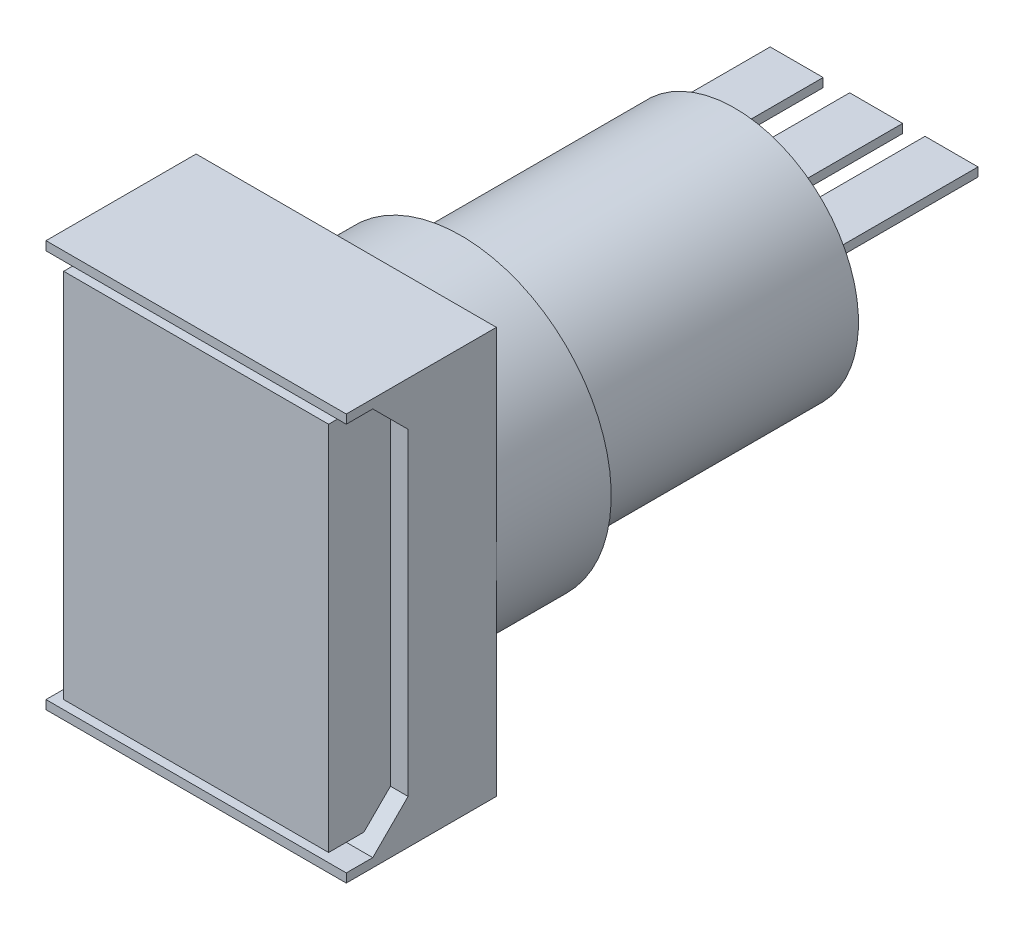
ISO-10303-21;
HEADER;
FILE_DESCRIPTION(('STEP AP214'),'2;1');
FILE_NAME('part.step','',(''),(''),'','','');
FILE_SCHEMA(('AUTOMOTIVE_DESIGN { 1 0 10303 214 1 1 1 1 }'));
ENDSEC;
DATA;
#1=APPLICATION_CONTEXT('core data for automotive mechanical design processes');
#2=APPLICATION_PROTOCOL_DEFINITION('international standard','automotive_design',2000,#1);
#3=PRODUCT_CONTEXT('',#1,'mechanical');
#4=PRODUCT('Part','Part','',(#3));
#5=PRODUCT_RELATED_PRODUCT_CATEGORY('part','',(#4));
#6=PRODUCT_DEFINITION_FORMATION('','',#4);
#7=PRODUCT_DEFINITION_CONTEXT('part definition',#1,'design');
#8=PRODUCT_DEFINITION('design','',#6,#7);
#9=PRODUCT_DEFINITION_SHAPE('','',#8);
#10=(LENGTH_UNIT() NAMED_UNIT(*) SI_UNIT(.MILLI.,.METRE.));
#11=(NAMED_UNIT(*) PLANE_ANGLE_UNIT() SI_UNIT($,.RADIAN.));
#12=(NAMED_UNIT(*) SI_UNIT($,.STERADIAN.) SOLID_ANGLE_UNIT());
#13=UNCERTAINTY_MEASURE_WITH_UNIT(LENGTH_MEASURE(1.E-05),#10,'distance_accuracy_value','');
#14=(GEOMETRIC_REPRESENTATION_CONTEXT(3) GLOBAL_UNCERTAINTY_ASSIGNED_CONTEXT((#13)) GLOBAL_UNIT_ASSIGNED_CONTEXT((#10,
#11,#12)) REPRESENTATION_CONTEXT('',''));
#15=CARTESIAN_POINT('',(0.,0.,0.));
#16=DIRECTION('',(0.,0.,1.));
#17=DIRECTION('',(1.,0.,0.));
#18=AXIS2_PLACEMENT_3D('',#15,#16,#17);
#19=CARTESIAN_POINT('',(-3.,3.,-30.));
#20=DIRECTION('',(0.,-1.,0.));
#21=DIRECTION('',(0.,0.,-1.));
#22=AXIS2_PLACEMENT_3D('',#19,#20,#21);
#23=PLANE('',#22);
#24=DIRECTION('',(0.,0.,1.));
#25=VECTOR('',#24,1.);
#26=CARTESIAN_POINT('',(-5.7662812973354,3.,-22.01));
#27=LINE('',#26,#25);
#28=CARTESIAN_POINT('',(-5.7662812973354,3.,-22.01));
#29=VERTEX_POINT('',#28);
#30=CARTESIAN_POINT('',(-5.7662812973354,3.,-22.));
#31=VERTEX_POINT('',#30);
#32=EDGE_CURVE('E243',#29,#31,#27,.T.);
#33=ORIENTED_EDGE('',*,*,#32,.F.);
#34=DIRECTION('',(1.,0.,0.));
#35=VECTOR('',#34,1.);
#36=CARTESIAN_POINT('',(-3.,3.,-22.01));
#37=LINE('',#36,#35);
#38=CARTESIAN_POINT('',(-3.,3.,-22.01));
#39=VERTEX_POINT('',#38);
#40=EDGE_CURVE('E843',#29,#39,#37,.T.);
#41=ORIENTED_EDGE('',*,*,#40,.T.);
#42=DIRECTION('',(0.,0.,1.));
#43=VECTOR('',#42,1.);
#44=CARTESIAN_POINT('',(-3.,3.,-30.));
#45=LINE('',#44,#43);
#46=CARTESIAN_POINT('',(-3.,3.,-30.));
#47=VERTEX_POINT('',#46);
#48=EDGE_CURVE('E273',#47,#39,#45,.T.);
#49=ORIENTED_EDGE('',*,*,#48,.F.);
#50=DIRECTION('',(1.,0.,0.));
#51=VECTOR('',#50,1.);
#52=CARTESIAN_POINT('',(-3.,3.,-30.));
#53=LINE('',#52,#51);
#54=CARTESIAN_POINT('',(-6.,3.,-30.));
#55=VERTEX_POINT('',#54);
#56=EDGE_CURVE('E836',#55,#47,#53,.T.);
#57=ORIENTED_EDGE('',*,*,#56,.F.);
#58=DIRECTION('',(0.,0.,1.));
#59=VECTOR('',#58,1.);
#60=CARTESIAN_POINT('',(-6.,3.,-30.));
#61=LINE('',#60,#59);
#62=CARTESIAN_POINT('',(-6.,3.,-22.));
#63=VERTEX_POINT('',#62);
#64=EDGE_CURVE('E276',#55,#63,#61,.T.);
#65=ORIENTED_EDGE('',*,*,#64,.T.);
#66=DIRECTION('',(1.,0.,0.));
#67=VECTOR('',#66,1.);
#68=CARTESIAN_POINT('',(-3.,3.,-22.));
#69=LINE('',#68,#67);
#70=EDGE_CURVE('E262',#63,#31,#69,.T.);
#71=ORIENTED_EDGE('',*,*,#70,.T.);
#72=EDGE_LOOP('',(#33,#41,#49,#57,#65,#71));
#73=FACE_BOUND('',#72,.T.);
#74=ADVANCED_FACE('F36',(#73),#23,.F.);
#75=CARTESIAN_POINT('',(0.,0.,-22.));
#76=DIRECTION('',(0.,0.,-1.));
#77=DIRECTION('',(-1.,0.,0.));
#78=AXIS2_PLACEMENT_3D('',#75,#76,#77);
#79=PLANE('',#78);
#80=CARTESIAN_POINT('',(0.,0.,-22.));
#81=DIRECTION('',(0.,0.,-1.));
#82=DIRECTION('',(-1.,0.,0.));
#83=AXIS2_PLACEMENT_3D('',#80,#81,#82);
#84=CIRCLE('',#83,7.);
#85=CARTESIAN_POINT('',(-7.,0.,-22.));
#86=VERTEX_POINT('',#85);
#87=EDGE_CURVE('E320',#86,#86,#84,.T.);
#88=ORIENTED_EDGE('',*,*,#87,.T.);
#89=EDGE_LOOP('',(#88));
#90=FACE_BOUND('',#89,.T.);
#91=CARTESIAN_POINT('',(0.,0.,-22.));
#92=DIRECTION('',(0.,0.,-1.));
#93=DIRECTION('',(-1.,0.,0.));
#94=AXIS2_PLACEMENT_3D('',#91,#92,#93);
#95=CIRCLE('',#94,6.5);
#96=CARTESIAN_POINT('',(-6.,2.5,-22.));
#97=VERTEX_POINT('',#96);
#98=EDGE_CURVE('E236',#31,#97,#95,.T.);
#99=ORIENTED_EDGE('',*,*,#98,.F.);
#100=ORIENTED_EDGE('',*,*,#70,.F.);
#101=DIRECTION('',(0.,1.,0.));
#102=VECTOR('',#101,1.);
#103=CARTESIAN_POINT('',(-6.,3.,-22.));
#104=LINE('',#103,#102);
#105=EDGE_CURVE('E255',#97,#63,#104,.T.);
#106=ORIENTED_EDGE('',*,*,#105,.F.);
#107=EDGE_LOOP('',(#99,#100,#106));
#108=FACE_BOUND('',#107,.T.);
#109=ADVANCED_FACE('F261',(#90,#108),#79,.T.);
#110=CARTESIAN_POINT('',(0.,0.,0.));
#111=DIRECTION('',(0.,0.,-1.));
#112=DIRECTION('',(-1.,0.,0.));
#113=AXIS2_PLACEMENT_3D('',#110,#111,#112);
#114=PLANE('',#113);
#115=CARTESIAN_POINT('',(0.,0.,0.));
#116=DIRECTION('',(0.,0.,-1.));
#117=DIRECTION('',(-1.,0.,0.));
#118=AXIS2_PLACEMENT_3D('',#115,#116,#117);
#119=CIRCLE('',#118,8.5);
#120=CARTESIAN_POINT('',(-8.5,0.,0.));
#121=VERTEX_POINT('',#120);
#122=CARTESIAN_POINT('',(8.5,0.,0.));
#123=VERTEX_POINT('',#122);
#124=EDGE_CURVE('E328',#121,#123,#119,.T.);
#125=ORIENTED_EDGE('',*,*,#124,.F.);
#126=DIRECTION('',(0.,-1.,0.));
#127=VECTOR('',#126,1.);
#128=CARTESIAN_POINT('',(-8.5,11.5,0.));
#129=LINE('',#128,#127);
#130=CARTESIAN_POINT('',(-8.5,11.5,0.));
#131=VERTEX_POINT('',#130);
#132=EDGE_CURVE('E418',#131,#121,#129,.T.);
#133=ORIENTED_EDGE('',*,*,#132,.F.);
#134=DIRECTION('',(-1.,0.,0.));
#135=VECTOR('',#134,1.);
#136=CARTESIAN_POINT('',(8.5,11.5,0.));
#137=LINE('',#136,#135);
#138=CARTESIAN_POINT('',(8.5,11.5,0.));
#139=VERTEX_POINT('',#138);
#140=EDGE_CURVE('E426',#139,#131,#137,.T.);
#141=ORIENTED_EDGE('',*,*,#140,.F.);
#142=DIRECTION('',(0.,1.,0.));
#143=VECTOR('',#142,1.);
#144=CARTESIAN_POINT('',(8.5,11.5,0.));
#145=LINE('',#144,#143);
#146=EDGE_CURVE('E422',#123,#139,#145,.T.);
#147=ORIENTED_EDGE('',*,*,#146,.F.);
#148=EDGE_LOOP('',(#125,#133,#141,#147));
#149=FACE_BOUND('',#148,.T.);
#150=ADVANCED_FACE('F469',(#149),#114,.T.);
#151=CARTESIAN_POINT('',(-11.5,11.,7.));
#152=DIRECTION('',(0.,0.707106781186548,-0.707106781186547));
#153=DIRECTION('',(0.,0.707106781186547,0.707106781186548));
#154=AXIS2_PLACEMENT_3D('',#151,#152,#153);
#155=PLANE('',#154);
#156=DIRECTION('',(0.,-0.707106781186547,-0.707106781186548));
#157=VECTOR('',#156,1.);
#158=CARTESIAN_POINT('',(-7.5,11.,7.));
#159=LINE('',#158,#157);
#160=CARTESIAN_POINT('',(-7.5,10.5,6.5));
#161=VERTEX_POINT('',#160);
#162=CARTESIAN_POINT('',(-7.5,9.00000000000001,5.));
#163=VERTEX_POINT('',#162);
#164=EDGE_CURVE('E360',#161,#163,#159,.T.);
#165=ORIENTED_EDGE('',*,*,#164,.F.);
#166=DIRECTION('',(-1.,0.,0.));
#167=VECTOR('',#166,1.);
#168=CARTESIAN_POINT('',(-11.5,10.5,6.5));
#169=LINE('',#168,#167);
#170=CARTESIAN_POINT('',(7.5,10.5,6.5));
#171=VERTEX_POINT('',#170);
#172=EDGE_CURVE('E454',#171,#161,#169,.T.);
#173=ORIENTED_EDGE('',*,*,#172,.F.);
#174=DIRECTION('',(0.,0.707106781186547,0.707106781186548));
#175=VECTOR('',#174,1.);
#176=CARTESIAN_POINT('',(7.5,11.,7.));
#177=LINE('',#176,#175);
#178=CARTESIAN_POINT('',(7.5,9.00000000000001,5.));
#179=VERTEX_POINT('',#178);
#180=EDGE_CURVE('E357',#179,#171,#177,.T.);
#181=ORIENTED_EDGE('',*,*,#180,.F.);
#182=DIRECTION('',(1.,0.,0.));
#183=VECTOR('',#182,1.);
#184=CARTESIAN_POINT('',(-11.5,9.00000000000001,5.));
#185=LINE('',#184,#183);
#186=CARTESIAN_POINT('',(8.5,9.00000000000001,5.));
#187=VERTEX_POINT('',#186);
#188=EDGE_CURVE('E384',#179,#187,#185,.T.);
#189=ORIENTED_EDGE('',*,*,#188,.T.);
#190=DIRECTION('',(0.,0.707106781186547,0.707106781186548));
#191=VECTOR('',#190,1.);
#192=CARTESIAN_POINT('',(8.5,11.,7.));
#193=LINE('',#192,#191);
#194=CARTESIAN_POINT('',(8.5,11.,7.));
#195=VERTEX_POINT('',#194);
#196=EDGE_CURVE('E372',#187,#195,#193,.T.);
#197=ORIENTED_EDGE('',*,*,#196,.T.);
#198=DIRECTION('',(1.,0.,0.));
#199=VECTOR('',#198,1.);
#200=CARTESIAN_POINT('',(-11.5,11.,7.));
#201=LINE('',#200,#199);
#202=CARTESIAN_POINT('',(-8.5,11.,7.));
#203=VERTEX_POINT('',#202);
#204=EDGE_CURVE('E378',#203,#195,#201,.T.);
#205=ORIENTED_EDGE('',*,*,#204,.F.);
#206=DIRECTION('',(0.,0.707106781186547,0.707106781186548));
#207=VECTOR('',#206,1.);
#208=CARTESIAN_POINT('',(-8.5,12.,8.));
#209=LINE('',#208,#207);
#210=CARTESIAN_POINT('',(-8.5,9.00000000000001,5.));
#211=VERTEX_POINT('',#210);
#212=EDGE_CURVE('E401',#211,#203,#209,.T.);
#213=ORIENTED_EDGE('',*,*,#212,.F.);
#214=EDGE_CURVE('E381',#211,#163,#185,.T.);
#215=ORIENTED_EDGE('',*,*,#214,.T.);
#216=EDGE_LOOP('',(#165,#173,#181,#189,#197,#205,#213,#215));
#217=FACE_BOUND('',#216,.T.);
#218=ADVANCED_FACE('F475',(#217),#155,.F.);
#219=CARTESIAN_POINT('',(-11.5,9.00000000000001,5.));
#220=DIRECTION('',(0.,0.,-1.));
#221=DIRECTION('',(-1.,0.,0.));
#222=AXIS2_PLACEMENT_3D('',#219,#220,#221);
#223=PLANE('',#222);
#224=DIRECTION('',(0.,-1.,0.));
#225=VECTOR('',#224,1.);
#226=CARTESIAN_POINT('',(-7.5,10.5,5.));
#227=LINE('',#226,#225);
#228=CARTESIAN_POINT('',(-7.5,-9.,5.));
#229=VERTEX_POINT('',#228);
#230=EDGE_CURVE('E327',#163,#229,#227,.T.);
#231=ORIENTED_EDGE('',*,*,#230,.F.);
#232=ORIENTED_EDGE('',*,*,#214,.F.);
#233=DIRECTION('',(0.,1.,0.));
#234=VECTOR('',#233,1.);
#235=CARTESIAN_POINT('',(-8.5,11.5,5.));
#236=LINE('',#235,#234);
#237=CARTESIAN_POINT('',(-8.5,-9.,5.));
#238=VERTEX_POINT('',#237);
#239=EDGE_CURVE('E398',#238,#211,#236,.T.);
#240=ORIENTED_EDGE('',*,*,#239,.F.);
#241=DIRECTION('',(1.,0.,0.));
#242=VECTOR('',#241,1.);
#243=CARTESIAN_POINT('',(-11.5,-9.,5.));
#244=LINE('',#243,#242);
#245=EDGE_CURVE('E385',#238,#229,#244,.T.);
#246=ORIENTED_EDGE('',*,*,#245,.T.);
#247=EDGE_LOOP('',(#231,#232,#240,#246));
#248=FACE_BOUND('',#247,.T.);
#249=ADVANCED_FACE('F518',(#248),#223,.F.);
#250=DIRECTION('',(0.,1.,0.));
#251=VECTOR('',#250,1.);
#252=CARTESIAN_POINT('',(7.5,10.5,5.));
#253=LINE('',#252,#251);
#254=CARTESIAN_POINT('',(7.5,-9.00000000000001,5.));
#255=VERTEX_POINT('',#254);
#256=EDGE_CURVE('E335',#255,#179,#253,.T.);
#257=ORIENTED_EDGE('',*,*,#256,.F.);
#258=CARTESIAN_POINT('',(8.5,-9.00000000000001,5.));
#259=VERTEX_POINT('',#258);
#260=EDGE_CURVE('E388',#255,#259,#244,.T.);
#261=ORIENTED_EDGE('',*,*,#260,.T.);
#262=DIRECTION('',(0.,1.,0.));
#263=VECTOR('',#262,1.);
#264=CARTESIAN_POINT('',(8.5,9.00000000000001,5.));
#265=LINE('',#264,#263);
#266=EDGE_CURVE('E369',#259,#187,#265,.T.);
#267=ORIENTED_EDGE('',*,*,#266,.T.);
#268=ORIENTED_EDGE('',*,*,#188,.F.);
#269=EDGE_LOOP('',(#257,#261,#267,#268));
#270=FACE_BOUND('',#269,.T.);
#271=ADVANCED_FACE('F522',(#270),#223,.F.);
#272=CARTESIAN_POINT('',(-11.5,-9.,5.));
#273=DIRECTION('',(0.,-0.707106781186548,-0.707106781186547));
#274=DIRECTION('',(0.,0.707106781186547,-0.707106781186548));
#275=AXIS2_PLACEMENT_3D('',#272,#273,#274);
#276=PLANE('',#275);
#277=DIRECTION('',(0.,-0.707106781186547,0.707106781186548));
#278=VECTOR('',#277,1.);
#279=CARTESIAN_POINT('',(-7.5,-9.,5.));
#280=LINE('',#279,#278);
#281=CARTESIAN_POINT('',(-7.5,-10.5,6.49999999999999));
#282=VERTEX_POINT('',#281);
#283=EDGE_CURVE('E451',#229,#282,#280,.T.);
#284=ORIENTED_EDGE('',*,*,#283,.F.);
#285=ORIENTED_EDGE('',*,*,#245,.F.);
#286=DIRECTION('',(0.,0.707106781186547,-0.707106781186548));
#287=VECTOR('',#286,1.);
#288=CARTESIAN_POINT('',(-8.5,-0.500000000000006,-3.5));
#289=LINE('',#288,#287);
#290=CARTESIAN_POINT('',(-8.5,-11.,7.));
#291=VERTEX_POINT('',#290);
#292=EDGE_CURVE('E395',#291,#238,#289,.T.);
#293=ORIENTED_EDGE('',*,*,#292,.F.);
#294=DIRECTION('',(1.,0.,0.));
#295=VECTOR('',#294,1.);
#296=CARTESIAN_POINT('',(-11.5,-11.,7.));
#297=LINE('',#296,#295);
#298=CARTESIAN_POINT('',(8.5,-11.,7.));
#299=VERTEX_POINT('',#298);
#300=EDGE_CURVE('E377',#291,#299,#297,.T.);
#301=ORIENTED_EDGE('',*,*,#300,.T.);
#302=DIRECTION('',(0.,0.707106781186547,-0.707106781186548));
#303=VECTOR('',#302,1.);
#304=CARTESIAN_POINT('',(8.5,-9.00000000000001,5.));
#305=LINE('',#304,#303);
#306=EDGE_CURVE('E366',#299,#259,#305,.T.);
#307=ORIENTED_EDGE('',*,*,#306,.T.);
#308=ORIENTED_EDGE('',*,*,#260,.F.);
#309=DIRECTION('',(0.,0.707106781186547,-0.707106781186548));
#310=VECTOR('',#309,1.);
#311=CARTESIAN_POINT('',(7.5,-9.,5.));
#312=LINE('',#311,#310);
#313=CARTESIAN_POINT('',(7.5,-10.5,6.49999999999999));
#314=VERTEX_POINT('',#313);
#315=EDGE_CURVE('E445',#314,#255,#312,.T.);
#316=ORIENTED_EDGE('',*,*,#315,.F.);
#317=DIRECTION('',(1.,0.,0.));
#318=VECTOR('',#317,1.);
#319=CARTESIAN_POINT('',(-11.5,-10.5,6.5));
#320=LINE('',#319,#318);
#321=EDGE_CURVE('E448',#282,#314,#320,.T.);
#322=ORIENTED_EDGE('',*,*,#321,.F.);
#323=EDGE_LOOP('',(#284,#285,#293,#301,#307,#308,#316,#322));
#324=FACE_BOUND('',#323,.T.);
#325=ADVANCED_FACE('F524',(#324),#276,.F.);
#326=CARTESIAN_POINT('',(0.,0.,8.5));
#327=DIRECTION('',(0.,0.,-1.));
#328=DIRECTION('',(-1.,0.,0.));
#329=AXIS2_PLACEMENT_3D('',#326,#327,#328);
#330=PLANE('',#329);
#331=DIRECTION('',(0.,-1.,0.));
#332=VECTOR('',#331,1.);
#333=CARTESIAN_POINT('',(-8.5,11.5,8.5));
#334=LINE('',#333,#332);
#335=CARTESIAN_POINT('',(-8.5,11.5,8.5));
#336=VERTEX_POINT('',#335);
#337=CARTESIAN_POINT('',(-8.5,11.,8.5));
#338=VERTEX_POINT('',#337);
#339=EDGE_CURVE('E405',#336,#338,#334,.T.);
#340=ORIENTED_EDGE('',*,*,#339,.T.);
#341=DIRECTION('',(1.,0.,0.));
#342=VECTOR('',#341,1.);
#343=CARTESIAN_POINT('',(0.,11.,8.5));
#344=LINE('',#343,#342);
#345=CARTESIAN_POINT('',(8.5,11.,8.5));
#346=VERTEX_POINT('',#345);
#347=EDGE_CURVE('E442',#338,#346,#344,.T.);
#348=ORIENTED_EDGE('',*,*,#347,.T.);
#349=DIRECTION('',(0.,1.,0.));
#350=VECTOR('',#349,1.);
#351=CARTESIAN_POINT('',(8.5,11.5,8.5));
#352=LINE('',#351,#350);
#353=CARTESIAN_POINT('',(8.5,11.5,8.5));
#354=VERTEX_POINT('',#353);
#355=EDGE_CURVE('E411',#346,#354,#352,.T.);
#356=ORIENTED_EDGE('',*,*,#355,.T.);
#357=DIRECTION('',(-1.,0.,0.));
#358=VECTOR('',#357,1.);
#359=CARTESIAN_POINT('',(8.5,11.5,8.5));
#360=LINE('',#359,#358);
#361=EDGE_CURVE('E415',#354,#336,#360,.T.);
#362=ORIENTED_EDGE('',*,*,#361,.T.);
#363=EDGE_LOOP('',(#340,#348,#356,#362));
#364=FACE_BOUND('',#363,.T.);
#365=ADVANCED_FACE('F527',(#364),#330,.F.);
#366=CARTESIAN_POINT('',(-8.5,11.5,8.5));
#367=DIRECTION('',(1.,0.,0.));
#368=DIRECTION('',(0.,1.,0.));
#369=AXIS2_PLACEMENT_3D('',#366,#367,#368);
#370=PLANE('',#369);
#371=ORIENTED_EDGE('',*,*,#212,.T.);
#372=DIRECTION('',(0.,0.,1.));
#373=VECTOR('',#372,1.);
#374=CARTESIAN_POINT('',(-8.5,11.,8.5));
#375=LINE('',#374,#373);
#376=EDGE_CURVE('E392',#203,#338,#375,.T.);
#377=ORIENTED_EDGE('',*,*,#376,.T.);
#378=ORIENTED_EDGE('',*,*,#339,.F.);
#379=DIRECTION('',(0.,0.,-1.));
#380=VECTOR('',#379,1.);
#381=CARTESIAN_POINT('',(-8.5,11.5,8.5));
#382=LINE('',#381,#380);
#383=EDGE_CURVE('E417',#336,#131,#382,.T.);
#384=ORIENTED_EDGE('',*,*,#383,.T.);
#385=ORIENTED_EDGE('',*,*,#132,.T.);
#386=CARTESIAN_POINT('',(-8.5,-11.5,0.));
#387=VERTEX_POINT('',#386);
#388=EDGE_CURVE('E404',#121,#387,#129,.T.);
#389=ORIENTED_EDGE('',*,*,#388,.T.);
#390=DIRECTION('',(0.,0.,-1.));
#391=VECTOR('',#390,1.);
#392=CARTESIAN_POINT('',(-8.5,-11.5,8.5));
#393=LINE('',#392,#391);
#394=CARTESIAN_POINT('',(-8.5,-11.5,8.5));
#395=VERTEX_POINT('',#394);
#396=EDGE_CURVE('E436',#395,#387,#393,.T.);
#397=ORIENTED_EDGE('',*,*,#396,.F.);
#398=CARTESIAN_POINT('',(-8.5,-11.,8.5));
#399=VERTEX_POINT('',#398);
#400=EDGE_CURVE('E409',#399,#395,#334,.T.);
#401=ORIENTED_EDGE('',*,*,#400,.F.);
#402=DIRECTION('',(0.,0.,-1.));
#403=VECTOR('',#402,1.);
#404=CARTESIAN_POINT('',(-8.5,-11.,8.5));
#405=LINE('',#404,#403);
#406=EDGE_CURVE('E380',#399,#291,#405,.T.);
#407=ORIENTED_EDGE('',*,*,#406,.T.);
#408=ORIENTED_EDGE('',*,*,#292,.T.);
#409=ORIENTED_EDGE('',*,*,#239,.T.);
#410=EDGE_LOOP('',(#371,#377,#378,#384,#385,#389,#397,#401,#407,#408,#409));
#411=FACE_BOUND('',#410,.T.);
#412=ADVANCED_FACE('F38',(#411),#370,.F.);
#413=CARTESIAN_POINT('',(8.5,-11.5,8.5));
#414=DIRECTION('',(0.,1.,0.));
#415=DIRECTION('',(-1.,0.,0.));
#416=AXIS2_PLACEMENT_3D('',#413,#414,#415);
#417=PLANE('',#416);
#418=DIRECTION('',(1.,0.,0.));
#419=VECTOR('',#418,1.);
#420=CARTESIAN_POINT('',(8.5,-11.5,0.));
#421=LINE('',#420,#419);
#422=CARTESIAN_POINT('',(8.5,-11.5,0.));
#423=VERTEX_POINT('',#422);
#424=EDGE_CURVE('E420',#387,#423,#421,.T.);
#425=ORIENTED_EDGE('',*,*,#424,.T.);
#426=DIRECTION('',(0.,0.,-1.));
#427=VECTOR('',#426,1.);
#428=CARTESIAN_POINT('',(8.5,-11.5,8.5));
#429=LINE('',#428,#427);
#430=CARTESIAN_POINT('',(8.5,-11.5,8.5));
#431=VERTEX_POINT('',#430);
#432=EDGE_CURVE('E433',#431,#423,#429,.T.);
#433=ORIENTED_EDGE('',*,*,#432,.F.);
#434=DIRECTION('',(1.,0.,0.));
#435=VECTOR('',#434,1.);
#436=CARTESIAN_POINT('',(8.5,-11.5,8.5));
#437=LINE('',#436,#435);
#438=EDGE_CURVE('E408',#395,#431,#437,.T.);
#439=ORIENTED_EDGE('',*,*,#438,.F.);
#440=ORIENTED_EDGE('',*,*,#396,.T.);
#441=EDGE_LOOP('',(#425,#433,#439,#440));
#442=FACE_BOUND('',#441,.T.);
#443=ADVANCED_FACE('F544',(#442),#417,.F.);
#444=CARTESIAN_POINT('',(8.5,11.5,8.5));
#445=DIRECTION('',(-1.,0.,0.));
#446=DIRECTION('',(0.,-1.,0.));
#447=AXIS2_PLACEMENT_3D('',#444,#445,#446);
#448=PLANE('',#447);
#449=ORIENTED_EDGE('',*,*,#355,.F.);
#450=DIRECTION('',(0.,0.,1.));
#451=VECTOR('',#450,1.);
#452=CARTESIAN_POINT('',(8.5,11.,8.5));
#453=LINE('',#452,#451);
#454=EDGE_CURVE('E375',#195,#346,#453,.T.);
#455=ORIENTED_EDGE('',*,*,#454,.F.);
#456=ORIENTED_EDGE('',*,*,#196,.F.);
#457=ORIENTED_EDGE('',*,*,#266,.F.);
#458=ORIENTED_EDGE('',*,*,#306,.F.);
#459=DIRECTION('',(0.,0.,-1.));
#460=VECTOR('',#459,1.);
#461=CARTESIAN_POINT('',(8.5,-11.,7.));
#462=LINE('',#461,#460);
#463=CARTESIAN_POINT('',(8.5,-11.,8.5));
#464=VERTEX_POINT('',#463);
#465=EDGE_CURVE('E363',#464,#299,#462,.T.);
#466=ORIENTED_EDGE('',*,*,#465,.F.);
#467=EDGE_CURVE('E412',#431,#464,#352,.T.);
#468=ORIENTED_EDGE('',*,*,#467,.F.);
#469=ORIENTED_EDGE('',*,*,#432,.T.);
#470=EDGE_CURVE('E423',#423,#123,#145,.T.);
#471=ORIENTED_EDGE('',*,*,#470,.T.);
#472=ORIENTED_EDGE('',*,*,#146,.T.);
#473=DIRECTION('',(0.,0.,-1.));
#474=VECTOR('',#473,1.);
#475=CARTESIAN_POINT('',(8.5,11.5,8.5));
#476=LINE('',#475,#474);
#477=EDGE_CURVE('E430',#354,#139,#476,.T.);
#478=ORIENTED_EDGE('',*,*,#477,.F.);
#479=EDGE_LOOP('',(#449,#455,#456,#457,#458,#466,#468,#469,#471,#472,#478));
#480=FACE_BOUND('',#479,.T.);
#481=ADVANCED_FACE('F541',(#480),#448,.F.);
#482=CARTESIAN_POINT('',(8.5,11.5,8.5));
#483=DIRECTION('',(0.,-1.,0.));
#484=DIRECTION('',(1.,0.,0.));
#485=AXIS2_PLACEMENT_3D('',#482,#483,#484);
#486=PLANE('',#485);
#487=ORIENTED_EDGE('',*,*,#140,.T.);
#488=ORIENTED_EDGE('',*,*,#383,.F.);
#489=ORIENTED_EDGE('',*,*,#361,.F.);
#490=ORIENTED_EDGE('',*,*,#477,.T.);
#491=EDGE_LOOP('',(#487,#488,#489,#490));
#492=FACE_BOUND('',#491,.T.);
#493=ADVANCED_FACE('F534',(#492),#486,.F.);
#494=ORIENTED_EDGE('',*,*,#467,.T.);
#495=DIRECTION('',(-1.,0.,0.));
#496=VECTOR('',#495,1.);
#497=CARTESIAN_POINT('',(0.,-11.,8.5));
#498=LINE('',#497,#496);
#499=EDGE_CURVE('E439',#464,#399,#498,.T.);
#500=ORIENTED_EDGE('',*,*,#499,.T.);
#501=ORIENTED_EDGE('',*,*,#400,.T.);
#502=ORIENTED_EDGE('',*,*,#438,.T.);
#503=EDGE_LOOP('',(#494,#500,#501,#502));
#504=FACE_BOUND('',#503,.T.);
#505=ADVANCED_FACE('F532',(#504),#330,.F.);
#506=EDGE_CURVE('E44',#123,#121,#119,.T.);
#507=ORIENTED_EDGE('',*,*,#506,.F.);
#508=ORIENTED_EDGE('',*,*,#470,.F.);
#509=ORIENTED_EDGE('',*,*,#424,.F.);
#510=ORIENTED_EDGE('',*,*,#388,.F.);
#511=EDGE_LOOP('',(#507,#508,#509,#510));
#512=FACE_BOUND('',#511,.T.);
#513=ADVANCED_FACE('F478',(#512),#114,.T.);
#514=CARTESIAN_POINT('',(-11.5,11.,8.5));
#515=DIRECTION('',(0.,1.,0.));
#516=DIRECTION('',(-1.,0.,0.));
#517=AXIS2_PLACEMENT_3D('',#514,#515,#516);
#518=PLANE('',#517);
#519=ORIENTED_EDGE('',*,*,#204,.T.);
#520=ORIENTED_EDGE('',*,*,#454,.T.);
#521=ORIENTED_EDGE('',*,*,#347,.F.);
#522=ORIENTED_EDGE('',*,*,#376,.F.);
#523=EDGE_LOOP('',(#519,#520,#521,#522));
#524=FACE_BOUND('',#523,.T.);
#525=ADVANCED_FACE('F512',(#524),#518,.F.);
#526=CARTESIAN_POINT('',(-11.5,-11.,7.));
#527=DIRECTION('',(0.,-1.,0.));
#528=DIRECTION('',(1.,0.,0.));
#529=AXIS2_PLACEMENT_3D('',#526,#527,#528);
#530=PLANE('',#529);
#531=ORIENTED_EDGE('',*,*,#499,.F.);
#532=ORIENTED_EDGE('',*,*,#465,.T.);
#533=ORIENTED_EDGE('',*,*,#300,.F.);
#534=ORIENTED_EDGE('',*,*,#406,.F.);
#535=EDGE_LOOP('',(#531,#532,#533,#534));
#536=FACE_BOUND('',#535,.T.);
#537=ADVANCED_FACE('F500',(#536),#530,.F.);
#538=CARTESIAN_POINT('',(7.5,10.5,8.5));
#539=DIRECTION('',(0.,-1.,0.));
#540=DIRECTION('',(0.,0.,-1.));
#541=AXIS2_PLACEMENT_3D('',#538,#539,#540);
#542=PLANE('',#541);
#543=DIRECTION('',(0.,0.,-1.));
#544=VECTOR('',#543,1.);
#545=CARTESIAN_POINT('',(7.5,10.5,8.5));
#546=LINE('',#545,#544);
#547=CARTESIAN_POINT('',(7.5,10.5,8.5));
#548=VERTEX_POINT('',#547);
#549=EDGE_CURVE('E348',#548,#171,#546,.T.);
#550=ORIENTED_EDGE('',*,*,#549,.T.);
#551=ORIENTED_EDGE('',*,*,#172,.T.);
#552=DIRECTION('',(0.,0.,-1.));
#553=VECTOR('',#552,1.);
#554=CARTESIAN_POINT('',(-7.5,10.5,8.5));
#555=LINE('',#554,#553);
#556=CARTESIAN_POINT('',(-7.5,10.5,8.5));
#557=VERTEX_POINT('',#556);
#558=EDGE_CURVE('E341',#557,#161,#555,.T.);
#559=ORIENTED_EDGE('',*,*,#558,.F.);
#560=DIRECTION('',(-1.,0.,0.));
#561=VECTOR('',#560,1.);
#562=CARTESIAN_POINT('',(7.5,10.5,8.5));
#563=LINE('',#562,#561);
#564=EDGE_CURVE('E339',#548,#557,#563,.T.);
#565=ORIENTED_EDGE('',*,*,#564,.F.);
#566=EDGE_LOOP('',(#550,#551,#559,#565));
#567=FACE_BOUND('',#566,.T.);
#568=ADVANCED_FACE('F496',(#567),#542,.F.);
#569=CARTESIAN_POINT('',(-7.5,10.5,8.5));
#570=DIRECTION('',(1.,0.,0.));
#571=DIRECTION('',(0.,1.,0.));
#572=AXIS2_PLACEMENT_3D('',#569,#570,#571);
#573=PLANE('',#572);
#574=ORIENTED_EDGE('',*,*,#558,.T.);
#575=ORIENTED_EDGE('',*,*,#164,.T.);
#576=ORIENTED_EDGE('',*,*,#230,.T.);
#577=ORIENTED_EDGE('',*,*,#283,.T.);
#578=DIRECTION('',(0.,0.,-1.));
#579=VECTOR('',#578,1.);
#580=CARTESIAN_POINT('',(-7.5,-10.5,8.5));
#581=LINE('',#580,#579);
#582=CARTESIAN_POINT('',(-7.5,-10.5,8.5));
#583=VERTEX_POINT('',#582);
#584=EDGE_CURVE('E354',#583,#282,#581,.T.);
#585=ORIENTED_EDGE('',*,*,#584,.F.);
#586=DIRECTION('',(0.,-1.,0.));
#587=VECTOR('',#586,1.);
#588=CARTESIAN_POINT('',(-7.5,10.5,8.5));
#589=LINE('',#588,#587);
#590=EDGE_CURVE('E331',#557,#583,#589,.T.);
#591=ORIENTED_EDGE('',*,*,#590,.F.);
#592=EDGE_LOOP('',(#574,#575,#576,#577,#585,#591));
#593=FACE_BOUND('',#592,.T.);
#594=ADVANCED_FACE('F499',(#593),#573,.F.);
#595=CARTESIAN_POINT('',(7.5,-10.5,8.5));
#596=DIRECTION('',(0.,1.,0.));
#597=DIRECTION('',(-1.,0.,0.));
#598=AXIS2_PLACEMENT_3D('',#595,#596,#597);
#599=PLANE('',#598);
#600=ORIENTED_EDGE('',*,*,#584,.T.);
#601=ORIENTED_EDGE('',*,*,#321,.T.);
#602=DIRECTION('',(0.,0.,-1.));
#603=VECTOR('',#602,1.);
#604=CARTESIAN_POINT('',(7.5,-10.5,8.5));
#605=LINE('',#604,#603);
#606=CARTESIAN_POINT('',(7.5,-10.5,8.5));
#607=VERTEX_POINT('',#606);
#608=EDGE_CURVE('E351',#607,#314,#605,.T.);
#609=ORIENTED_EDGE('',*,*,#608,.F.);
#610=DIRECTION('',(1.,0.,0.));
#611=VECTOR('',#610,1.);
#612=CARTESIAN_POINT('',(7.5,-10.5,8.5));
#613=LINE('',#612,#611);
#614=EDGE_CURVE('E334',#583,#607,#613,.T.);
#615=ORIENTED_EDGE('',*,*,#614,.F.);
#616=EDGE_LOOP('',(#600,#601,#609,#615));
#617=FACE_BOUND('',#616,.T.);
#618=ADVANCED_FACE('F504',(#617),#599,.F.);
#619=CARTESIAN_POINT('',(7.5,10.5,8.5));
#620=DIRECTION('',(-1.,0.,0.));
#621=DIRECTION('',(0.,-1.,0.));
#622=AXIS2_PLACEMENT_3D('',#619,#620,#621);
#623=PLANE('',#622);
#624=ORIENTED_EDGE('',*,*,#256,.T.);
#625=ORIENTED_EDGE('',*,*,#180,.T.);
#626=ORIENTED_EDGE('',*,*,#549,.F.);
#627=DIRECTION('',(0.,1.,0.));
#628=VECTOR('',#627,1.);
#629=CARTESIAN_POINT('',(7.5,10.5,8.5));
#630=LINE('',#629,#628);
#631=EDGE_CURVE('E337',#607,#548,#630,.T.);
#632=ORIENTED_EDGE('',*,*,#631,.F.);
#633=ORIENTED_EDGE('',*,*,#608,.T.);
#634=ORIENTED_EDGE('',*,*,#315,.T.);
#635=EDGE_LOOP('',(#624,#625,#626,#632,#633,#634));
#636=FACE_BOUND('',#635,.T.);
#637=ADVANCED_FACE('F494',(#636),#623,.F.);
#638=CARTESIAN_POINT('',(0.,0.,8.5));
#639=DIRECTION('',(0.,0.,-1.));
#640=DIRECTION('',(-1.,0.,0.));
#641=AXIS2_PLACEMENT_3D('',#638,#639,#640);
#642=PLANE('',#641);
#643=ORIENTED_EDGE('',*,*,#590,.T.);
#644=ORIENTED_EDGE('',*,*,#614,.T.);
#645=ORIENTED_EDGE('',*,*,#631,.T.);
#646=ORIENTED_EDGE('',*,*,#564,.T.);
#647=EDGE_LOOP('',(#643,#644,#645,#646));
#648=FACE_BOUND('',#647,.T.);
#649=ADVANCED_FACE('F490',(#648),#642,.F.);
#650=CARTESIAN_POINT('',(0.,0.,-6.5));
#651=DIRECTION('',(0.,0.,1.));
#652=DIRECTION('',(1.,0.,0.));
#653=AXIS2_PLACEMENT_3D('',#650,#651,#652);
#654=CYLINDRICAL_SURFACE('',#653,8.5);
#655=CARTESIAN_POINT('',(0.,0.,-6.5));
#656=DIRECTION('',(0.,0.,-1.));
#657=DIRECTION('',(-1.,0.,0.));
#658=AXIS2_PLACEMENT_3D('',#655,#656,#657);
#659=CIRCLE('',#658,8.5);
#660=CARTESIAN_POINT('',(-8.5,0.,-6.5));
#661=VERTEX_POINT('',#660);
#662=EDGE_CURVE('E324',#661,#661,#659,.T.);
#663=ORIENTED_EDGE('',*,*,#662,.F.);
#664=EDGE_LOOP('',(#663));
#665=FACE_BOUND('',#664,.T.);
#666=ORIENTED_EDGE('',*,*,#124,.T.);
#667=ORIENTED_EDGE('',*,*,#506,.T.);
#668=EDGE_LOOP('',(#666,#667));
#669=FACE_BOUND('',#668,.T.);
#670=ADVANCED_FACE('F487',(#665,#669),#654,.T.);
#671=CARTESIAN_POINT('',(0.,0.,-6.5));
#672=DIRECTION('',(0.,0.,-1.));
#673=DIRECTION('',(-1.,0.,0.));
#674=AXIS2_PLACEMENT_3D('',#671,#672,#673);
#675=PLANE('',#674);
#676=CARTESIAN_POINT('',(0.,0.,-6.5));
#677=DIRECTION('',(0.,0.,-1.));
#678=DIRECTION('',(-1.,0.,0.));
#679=AXIS2_PLACEMENT_3D('',#676,#677,#678);
#680=CIRCLE('',#679,7.);
#681=CARTESIAN_POINT('',(-7.,0.,-6.5));
#682=VERTEX_POINT('',#681);
#683=EDGE_CURVE('E323',#682,#682,#680,.F.);
#684=ORIENTED_EDGE('',*,*,#683,.T.);
#685=EDGE_LOOP('',(#684));
#686=FACE_BOUND('',#685,.T.);
#687=ORIENTED_EDGE('',*,*,#662,.T.);
#688=EDGE_LOOP('',(#687));
#689=FACE_BOUND('',#688,.T.);
#690=ADVANCED_FACE('F459',(#686,#689),#675,.T.);
#691=CARTESIAN_POINT('',(0.,0.,-22.));
#692=DIRECTION('',(0.,0.,1.));
#693=DIRECTION('',(1.,0.,0.));
#694=AXIS2_PLACEMENT_3D('',#691,#692,#693);
#695=CYLINDRICAL_SURFACE('',#694,7.);
#696=ORIENTED_EDGE('',*,*,#683,.F.);
#697=EDGE_LOOP('',(#696));
#698=FACE_BOUND('',#697,.T.);
#699=ORIENTED_EDGE('',*,*,#87,.F.);
#700=EDGE_LOOP('',(#699));
#701=FACE_BOUND('',#700,.T.);
#702=ADVANCED_FACE('F462',(#698,#701),#695,.T.);
#703=CARTESIAN_POINT('',(-6.,3.,-30.));
#704=DIRECTION('',(1.,0.,0.));
#705=DIRECTION('',(0.,1.,0.));
#706=AXIS2_PLACEMENT_3D('',#703,#704,#705);
#707=PLANE('',#706);
#708=ORIENTED_EDGE('',*,*,#105,.T.);
#709=ORIENTED_EDGE('',*,*,#64,.F.);
#710=DIRECTION('',(0.,1.,0.));
#711=VECTOR('',#710,1.);
#712=CARTESIAN_POINT('',(-6.,3.,-30.));
#713=LINE('',#712,#711);
#714=CARTESIAN_POINT('',(-6.,2.5,-30.));
#715=VERTEX_POINT('',#714);
#716=EDGE_CURVE('E264',#715,#55,#713,.T.);
#717=ORIENTED_EDGE('',*,*,#716,.F.);
#718=DIRECTION('',(0.,0.,1.));
#719=VECTOR('',#718,1.);
#720=CARTESIAN_POINT('',(-6.,2.5,-30.));
#721=LINE('',#720,#719);
#722=CARTESIAN_POINT('',(-6.,2.5,-22.01));
#723=VERTEX_POINT('',#722);
#724=EDGE_CURVE('E258',#715,#723,#721,.T.);
#725=ORIENTED_EDGE('',*,*,#724,.T.);
#726=EDGE_CURVE('E240',#723,#97,#721,.T.);
#727=ORIENTED_EDGE('',*,*,#726,.T.);
#728=EDGE_LOOP('',(#708,#709,#717,#725,#727));
#729=FACE_BOUND('',#728,.T.);
#730=ADVANCED_FACE('F253',(#729),#707,.F.);
#731=CARTESIAN_POINT('',(-3.,3.,-30.));
#732=DIRECTION('',(-1.,0.,0.));
#733=DIRECTION('',(0.,0.,1.));
#734=AXIS2_PLACEMENT_3D('',#731,#732,#733);
#735=PLANE('',#734);
#736=ORIENTED_EDGE('',*,*,#48,.T.);
#737=DIRECTION('',(0.,-1.,0.));
#738=VECTOR('',#737,1.);
#739=CARTESIAN_POINT('',(-3.,3.,-22.01));
#740=LINE('',#739,#738);
#741=CARTESIAN_POINT('',(-3.,2.5,-22.01));
#742=VERTEX_POINT('',#741);
#743=EDGE_CURVE('E845',#39,#742,#740,.T.);
#744=ORIENTED_EDGE('',*,*,#743,.T.);
#745=DIRECTION('',(0.,0.,1.));
#746=VECTOR('',#745,1.);
#747=CARTESIAN_POINT('',(-3.,2.5,-30.));
#748=LINE('',#747,#746);
#749=CARTESIAN_POINT('',(-3.,2.5,-30.));
#750=VERTEX_POINT('',#749);
#751=EDGE_CURVE('E270',#750,#742,#748,.T.);
#752=ORIENTED_EDGE('',*,*,#751,.F.);
#753=DIRECTION('',(0.,-1.,0.));
#754=VECTOR('',#753,1.);
#755=CARTESIAN_POINT('',(-3.,3.,-30.));
#756=LINE('',#755,#754);
#757=EDGE_CURVE('E837',#47,#750,#756,.T.);
#758=ORIENTED_EDGE('',*,*,#757,.F.);
#759=EDGE_LOOP('',(#736,#744,#752,#758));
#760=FACE_BOUND('',#759,.T.);
#761=ADVANCED_FACE('F715',(#760),#735,.F.);
#762=CARTESIAN_POINT('',(-3.,2.5,-30.));
#763=DIRECTION('',(0.,1.,0.));
#764=DIRECTION('',(0.,0.,1.));
#765=AXIS2_PLACEMENT_3D('',#762,#763,#764);
#766=PLANE('',#765);
#767=ORIENTED_EDGE('',*,*,#751,.T.);
#768=DIRECTION('',(-1.,0.,0.));
#769=VECTOR('',#768,1.);
#770=CARTESIAN_POINT('',(-3.,2.5,-22.01));
#771=LINE('',#770,#769);
#772=EDGE_CURVE('E11',#742,#723,#771,.T.);
#773=ORIENTED_EDGE('',*,*,#772,.T.);
#774=ORIENTED_EDGE('',*,*,#724,.F.);
#775=DIRECTION('',(-1.,0.,0.));
#776=VECTOR('',#775,1.);
#777=CARTESIAN_POINT('',(-3.,2.5,-30.));
#778=LINE('',#777,#776);
#779=EDGE_CURVE('E259',#750,#715,#778,.T.);
#780=ORIENTED_EDGE('',*,*,#779,.F.);
#781=EDGE_LOOP('',(#767,#773,#774,#780));
#782=FACE_BOUND('',#781,.T.);
#783=ADVANCED_FACE('F693',(#782),#766,.F.);
#784=CARTESIAN_POINT('',(0.,0.,-30.));
#785=DIRECTION('',(0.,0.,-1.));
#786=DIRECTION('',(-1.,0.,0.));
#787=AXIS2_PLACEMENT_3D('',#784,#785,#786);
#788=PLANE('',#787);
#789=ORIENTED_EDGE('',*,*,#716,.T.);
#790=ORIENTED_EDGE('',*,*,#56,.T.);
#791=ORIENTED_EDGE('',*,*,#757,.T.);
#792=ORIENTED_EDGE('',*,*,#779,.T.);
#793=EDGE_LOOP('',(#789,#790,#791,#792));
#794=FACE_BOUND('',#793,.T.);
#795=ADVANCED_FACE('F688',(#794),#788,.T.);
#796=CARTESIAN_POINT('',(0.,0.,-22.01));
#797=DIRECTION('',(0.,0.,1.));
#798=DIRECTION('',(1.,0.,0.));
#799=AXIS2_PLACEMENT_3D('',#796,#797,#798);
#800=CYLINDRICAL_SURFACE('',#799,6.5);
#801=CARTESIAN_POINT('',(0.,0.,-22.01));
#802=DIRECTION('',(0.,0.,-1.));
#803=DIRECTION('',(-1.,0.,0.));
#804=AXIS2_PLACEMENT_3D('',#801,#802,#803);
#805=CIRCLE('',#804,6.5);
#806=CARTESIAN_POINT('',(5.7662812973354,3.,-22.01));
#807=VERTEX_POINT('',#806);
#808=EDGE_CURVE('E248',#807,#723,#805,.T.);
#809=ORIENTED_EDGE('',*,*,#808,.F.);
#810=EDGE_CURVE('E846',#29,#807,#805,.T.);
#811=ORIENTED_EDGE('',*,*,#810,.F.);
#812=ORIENTED_EDGE('',*,*,#32,.T.);
#813=ORIENTED_EDGE('',*,*,#98,.T.);
#814=ORIENTED_EDGE('',*,*,#726,.F.);
#815=EDGE_LOOP('',(#809,#811,#812,#813,#814));
#816=FACE_BOUND('',#815,.T.);
#817=ADVANCED_FACE('F239',(#816),#800,.T.);
#818=CARTESIAN_POINT('',(0.,0.,-22.01));
#819=DIRECTION('',(0.,0.,-1.));
#820=DIRECTION('',(-1.,0.,0.));
#821=AXIS2_PLACEMENT_3D('',#818,#819,#820);
#822=PLANE('',#821);
#823=DIRECTION('',(0.,1.,0.));
#824=VECTOR('',#823,1.);
#825=CARTESIAN_POINT('',(-1.5,3.,-22.01));
#826=LINE('',#825,#824);
#827=CARTESIAN_POINT('',(-1.5,2.5,-22.01));
#828=VERTEX_POINT('',#827);
#829=CARTESIAN_POINT('',(-1.5,3.,-22.01));
#830=VERTEX_POINT('',#829);
#831=EDGE_CURVE('E59',#828,#830,#826,.T.);
#832=ORIENTED_EDGE('',*,*,#831,.F.);
#833=DIRECTION('',(-1.,0.,0.));
#834=VECTOR('',#833,1.);
#835=CARTESIAN_POINT('',(1.5,2.5,-22.01));
#836=LINE('',#835,#834);
#837=CARTESIAN_POINT('',(1.5,2.5,-22.01));
#838=VERTEX_POINT('',#837);
#839=EDGE_CURVE('E848',#838,#828,#836,.T.);
#840=ORIENTED_EDGE('',*,*,#839,.F.);
#841=DIRECTION('',(0.,-1.,0.));
#842=VECTOR('',#841,1.);
#843=CARTESIAN_POINT('',(1.5,3.,-22.01));
#844=LINE('',#843,#842);
#845=CARTESIAN_POINT('',(1.5,3.,-22.01));
#846=VERTEX_POINT('',#845);
#847=EDGE_CURVE('E854',#846,#838,#844,.T.);
#848=ORIENTED_EDGE('',*,*,#847,.F.);
#849=DIRECTION('',(1.,0.,0.));
#850=VECTOR('',#849,1.);
#851=CARTESIAN_POINT('',(1.5,3.,-22.01));
#852=LINE('',#851,#850);
#853=EDGE_CURVE('E827',#830,#846,#852,.T.);
#854=ORIENTED_EDGE('',*,*,#853,.F.);
#855=EDGE_LOOP('',(#832,#840,#848,#854));
#856=FACE_BOUND('',#855,.T.);
#857=DIRECTION('',(0.,1.,0.));
#858=VECTOR('',#857,1.);
#859=CARTESIAN_POINT('',(2.7662812973354,3.,-22.01));
#860=LINE('',#859,#858);
#861=CARTESIAN_POINT('',(2.7662812973354,2.5,-22.01));
#862=VERTEX_POINT('',#861);
#863=CARTESIAN_POINT('',(2.7662812973354,3.,-22.01));
#864=VERTEX_POINT('',#863);
#865=EDGE_CURVE('E51',#862,#864,#860,.T.);
#866=ORIENTED_EDGE('',*,*,#865,.F.);
#867=DIRECTION('',(-1.,0.,0.));
#868=VECTOR('',#867,1.);
#869=CARTESIAN_POINT('',(5.7662812973354,2.5,-22.01));
#870=LINE('',#869,#868);
#871=CARTESIAN_POINT('',(5.7662812973354,2.5,-22.01));
#872=VERTEX_POINT('',#871);
#873=EDGE_CURVE('E820',#872,#862,#870,.T.);
#874=ORIENTED_EDGE('',*,*,#873,.F.);
#875=DIRECTION('',(0.,-1.,0.));
#876=VECTOR('',#875,1.);
#877=CARTESIAN_POINT('',(5.7662812973354,3.,-22.01));
#878=LINE('',#877,#876);
#879=EDGE_CURVE('E823',#807,#872,#878,.T.);
#880=ORIENTED_EDGE('',*,*,#879,.F.);
#881=ORIENTED_EDGE('',*,*,#808,.T.);
#882=ORIENTED_EDGE('',*,*,#772,.F.);
#883=ORIENTED_EDGE('',*,*,#743,.F.);
#884=ORIENTED_EDGE('',*,*,#40,.F.);
#885=ORIENTED_EDGE('',*,*,#810,.T.);
#886=DIRECTION('',(1.,0.,0.));
#887=VECTOR('',#886,1.);
#888=CARTESIAN_POINT('',(5.7662812973354,3.,-22.01));
#889=LINE('',#888,#887);
#890=EDGE_CURVE('E825',#864,#807,#889,.T.);
#891=ORIENTED_EDGE('',*,*,#890,.F.);
#892=EDGE_LOOP('',(#866,#874,#880,#881,#882,#883,#884,#885,#891));
#893=FACE_BOUND('',#892,.T.);
#894=ADVANCED_FACE('F678',(#856,#893),#822,.T.);
#895=CARTESIAN_POINT('',(0.,0.,-30.));
#896=DIRECTION('',(0.,0.,-1.));
#897=DIRECTION('',(-1.,0.,0.));
#898=AXIS2_PLACEMENT_3D('',#895,#896,#897);
#899=PLANE('',#898);
#900=DIRECTION('',(0.,1.,0.));
#901=VECTOR('',#900,1.);
#902=CARTESIAN_POINT('',(-1.5,3.,-30.));
#903=LINE('',#902,#901);
#904=CARTESIAN_POINT('',(-1.5,2.5,-30.));
#905=VERTEX_POINT('',#904);
#906=CARTESIAN_POINT('',(-1.5,3.,-30.));
#907=VERTEX_POINT('',#906);
#908=EDGE_CURVE('E278',#905,#907,#903,.T.);
#909=ORIENTED_EDGE('',*,*,#908,.T.);
#910=DIRECTION('',(1.,0.,0.));
#911=VECTOR('',#910,1.);
#912=CARTESIAN_POINT('',(1.5,3.,-30.));
#913=LINE('',#912,#911);
#914=CARTESIAN_POINT('',(1.5,3.,-30.));
#915=VERTEX_POINT('',#914);
#916=EDGE_CURVE('E281',#907,#915,#913,.T.);
#917=ORIENTED_EDGE('',*,*,#916,.T.);
#918=DIRECTION('',(0.,-1.,0.));
#919=VECTOR('',#918,1.);
#920=CARTESIAN_POINT('',(1.5,3.,-30.));
#921=LINE('',#920,#919);
#922=CARTESIAN_POINT('',(1.5,2.5,-30.));
#923=VERTEX_POINT('',#922);
#924=EDGE_CURVE('E283',#915,#923,#921,.T.);
#925=ORIENTED_EDGE('',*,*,#924,.T.);
#926=DIRECTION('',(-1.,0.,0.));
#927=VECTOR('',#926,1.);
#928=CARTESIAN_POINT('',(1.5,2.5,-30.));
#929=LINE('',#928,#927);
#930=EDGE_CURVE('E285',#923,#905,#929,.T.);
#931=ORIENTED_EDGE('',*,*,#930,.T.);
#932=EDGE_LOOP('',(#909,#917,#925,#931));
#933=FACE_BOUND('',#932,.T.);
#934=ADVANCED_FACE('F672',(#933),#899,.T.);
#935=CARTESIAN_POINT('',(1.5,2.5,-30.));
#936=DIRECTION('',(0.,1.,0.));
#937=DIRECTION('',(0.,0.,1.));
#938=AXIS2_PLACEMENT_3D('',#935,#936,#937);
#939=PLANE('',#938);
#940=DIRECTION('',(0.,0.,1.));
#941=VECTOR('',#940,1.);
#942=CARTESIAN_POINT('',(1.5,2.5,-30.));
#943=LINE('',#942,#941);
#944=EDGE_CURVE('E290',#923,#838,#943,.T.);
#945=ORIENTED_EDGE('',*,*,#944,.T.);
#946=ORIENTED_EDGE('',*,*,#839,.T.);
#947=DIRECTION('',(0.,0.,1.));
#948=VECTOR('',#947,1.);
#949=CARTESIAN_POINT('',(-1.5,2.5,-30.));
#950=LINE('',#949,#948);
#951=EDGE_CURVE('E287',#905,#828,#950,.T.);
#952=ORIENTED_EDGE('',*,*,#951,.F.);
#953=ORIENTED_EDGE('',*,*,#930,.F.);
#954=EDGE_LOOP('',(#945,#946,#952,#953));
#955=FACE_BOUND('',#954,.T.);
#956=ADVANCED_FACE('F677',(#955),#939,.F.);
#957=CARTESIAN_POINT('',(1.5,3.,-30.));
#958=DIRECTION('',(-1.,0.,0.));
#959=DIRECTION('',(0.,-1.,0.));
#960=AXIS2_PLACEMENT_3D('',#957,#958,#959);
#961=PLANE('',#960);
#962=DIRECTION('',(0.,0.,1.));
#963=VECTOR('',#962,1.);
#964=CARTESIAN_POINT('',(1.5,3.,-30.));
#965=LINE('',#964,#963);
#966=EDGE_CURVE('E293',#915,#846,#965,.T.);
#967=ORIENTED_EDGE('',*,*,#966,.T.);
#968=ORIENTED_EDGE('',*,*,#847,.T.);
#969=ORIENTED_EDGE('',*,*,#944,.F.);
#970=ORIENTED_EDGE('',*,*,#924,.F.);
#971=EDGE_LOOP('',(#967,#968,#969,#970));
#972=FACE_BOUND('',#971,.T.);
#973=ADVANCED_FACE('F752',(#972),#961,.F.);
#974=CARTESIAN_POINT('',(1.5,3.,-30.));
#975=DIRECTION('',(0.,-1.,0.));
#976=DIRECTION('',(0.,0.,-1.));
#977=AXIS2_PLACEMENT_3D('',#974,#975,#976);
#978=PLANE('',#977);
#979=DIRECTION('',(0.,0.,1.));
#980=VECTOR('',#979,1.);
#981=CARTESIAN_POINT('',(-1.5,3.,-30.));
#982=LINE('',#981,#980);
#983=EDGE_CURVE('E296',#907,#830,#982,.T.);
#984=ORIENTED_EDGE('',*,*,#983,.T.);
#985=ORIENTED_EDGE('',*,*,#853,.T.);
#986=ORIENTED_EDGE('',*,*,#966,.F.);
#987=ORIENTED_EDGE('',*,*,#916,.F.);
#988=EDGE_LOOP('',(#984,#985,#986,#987));
#989=FACE_BOUND('',#988,.T.);
#990=ADVANCED_FACE('F762',(#989),#978,.F.);
#991=CARTESIAN_POINT('',(-1.5,3.,-30.));
#992=DIRECTION('',(1.,0.,0.));
#993=DIRECTION('',(0.,1.,0.));
#994=AXIS2_PLACEMENT_3D('',#991,#992,#993);
#995=PLANE('',#994);
#996=ORIENTED_EDGE('',*,*,#951,.T.);
#997=ORIENTED_EDGE('',*,*,#831,.T.);
#998=ORIENTED_EDGE('',*,*,#983,.F.);
#999=ORIENTED_EDGE('',*,*,#908,.F.);
#1000=EDGE_LOOP('',(#996,#997,#998,#999));
#1001=FACE_BOUND('',#1000,.T.);
#1002=ADVANCED_FACE('F662',(#1001),#995,.F.);
#1003=CARTESIAN_POINT('',(0.,0.,-30.));
#1004=DIRECTION('',(0.,0.,-1.));
#1005=DIRECTION('',(-1.,0.,0.));
#1006=AXIS2_PLACEMENT_3D('',#1003,#1004,#1005);
#1007=PLANE('',#1006);
#1008=DIRECTION('',(0.,1.,0.));
#1009=VECTOR('',#1008,1.);
#1010=CARTESIAN_POINT('',(2.7662812973354,3.,-30.));
#1011=LINE('',#1010,#1009);
#1012=CARTESIAN_POINT('',(2.7662812973354,2.5,-30.));
#1013=VERTEX_POINT('',#1012);
#1014=CARTESIAN_POINT('',(2.7662812973354,3.,-30.));
#1015=VERTEX_POINT('',#1014);
#1016=EDGE_CURVE('E299',#1013,#1015,#1011,.T.);
#1017=ORIENTED_EDGE('',*,*,#1016,.T.);
#1018=DIRECTION('',(1.,0.,0.));
#1019=VECTOR('',#1018,1.);
#1020=CARTESIAN_POINT('',(5.7662812973354,3.,-30.));
#1021=LINE('',#1020,#1019);
#1022=CARTESIAN_POINT('',(5.7662812973354,3.,-30.));
#1023=VERTEX_POINT('',#1022);
#1024=EDGE_CURVE('E302',#1015,#1023,#1021,.T.);
#1025=ORIENTED_EDGE('',*,*,#1024,.T.);
#1026=DIRECTION('',(0.,-1.,0.));
#1027=VECTOR('',#1026,1.);
#1028=CARTESIAN_POINT('',(5.7662812973354,3.,-30.));
#1029=LINE('',#1028,#1027);
#1030=CARTESIAN_POINT('',(5.7662812973354,2.5,-30.));
#1031=VERTEX_POINT('',#1030);
#1032=EDGE_CURVE('E304',#1023,#1031,#1029,.T.);
#1033=ORIENTED_EDGE('',*,*,#1032,.T.);
#1034=DIRECTION('',(-1.,0.,0.));
#1035=VECTOR('',#1034,1.);
#1036=CARTESIAN_POINT('',(5.7662812973354,2.5,-30.));
#1037=LINE('',#1036,#1035);
#1038=EDGE_CURVE('E306',#1031,#1013,#1037,.T.);
#1039=ORIENTED_EDGE('',*,*,#1038,.T.);
#1040=EDGE_LOOP('',(#1017,#1025,#1033,#1039));
#1041=FACE_BOUND('',#1040,.T.);
#1042=ADVANCED_FACE('F656',(#1041),#1007,.T.);
#1043=CARTESIAN_POINT('',(5.7662812973354,2.5,-30.));
#1044=DIRECTION('',(0.,1.,0.));
#1045=DIRECTION('',(0.,0.,1.));
#1046=AXIS2_PLACEMENT_3D('',#1043,#1044,#1045);
#1047=PLANE('',#1046);
#1048=DIRECTION('',(0.,0.,1.));
#1049=VECTOR('',#1048,1.);
#1050=CARTESIAN_POINT('',(5.7662812973354,2.5,-30.));
#1051=LINE('',#1050,#1049);
#1052=EDGE_CURVE('E311',#1031,#872,#1051,.T.);
#1053=ORIENTED_EDGE('',*,*,#1052,.T.);
#1054=ORIENTED_EDGE('',*,*,#873,.T.);
#1055=DIRECTION('',(0.,0.,1.));
#1056=VECTOR('',#1055,1.);
#1057=CARTESIAN_POINT('',(2.7662812973354,2.5,-30.));
#1058=LINE('',#1057,#1056);
#1059=EDGE_CURVE('E308',#1013,#862,#1058,.T.);
#1060=ORIENTED_EDGE('',*,*,#1059,.F.);
#1061=ORIENTED_EDGE('',*,*,#1038,.F.);
#1062=EDGE_LOOP('',(#1053,#1054,#1060,#1061));
#1063=FACE_BOUND('',#1062,.T.);
#1064=ADVANCED_FACE('F661',(#1063),#1047,.F.);
#1065=CARTESIAN_POINT('',(5.7662812973354,3.,-30.));
#1066=DIRECTION('',(-1.,0.,0.));
#1067=DIRECTION('',(0.,-1.,0.));
#1068=AXIS2_PLACEMENT_3D('',#1065,#1066,#1067);
#1069=PLANE('',#1068);
#1070=DIRECTION('',(0.,0.,1.));
#1071=VECTOR('',#1070,1.);
#1072=CARTESIAN_POINT('',(5.7662812973354,3.,-30.));
#1073=LINE('',#1072,#1071);
#1074=EDGE_CURVE('E314',#1023,#807,#1073,.T.);
#1075=ORIENTED_EDGE('',*,*,#1074,.T.);
#1076=ORIENTED_EDGE('',*,*,#879,.T.);
#1077=ORIENTED_EDGE('',*,*,#1052,.F.);
#1078=ORIENTED_EDGE('',*,*,#1032,.F.);
#1079=EDGE_LOOP('',(#1075,#1076,#1077,#1078));
#1080=FACE_BOUND('',#1079,.T.);
#1081=ADVANCED_FACE('F786',(#1080),#1069,.F.);
#1082=CARTESIAN_POINT('',(5.7662812973354,3.,-30.));
#1083=DIRECTION('',(0.,-1.,0.));
#1084=DIRECTION('',(0.,0.,-1.));
#1085=AXIS2_PLACEMENT_3D('',#1082,#1083,#1084);
#1086=PLANE('',#1085);
#1087=DIRECTION('',(0.,0.,1.));
#1088=VECTOR('',#1087,1.);
#1089=CARTESIAN_POINT('',(2.7662812973354,3.,-30.));
#1090=LINE('',#1089,#1088);
#1091=EDGE_CURVE('E317',#1015,#864,#1090,.T.);
#1092=ORIENTED_EDGE('',*,*,#1091,.T.);
#1093=ORIENTED_EDGE('',*,*,#890,.T.);
#1094=ORIENTED_EDGE('',*,*,#1074,.F.);
#1095=ORIENTED_EDGE('',*,*,#1024,.F.);
#1096=EDGE_LOOP('',(#1092,#1093,#1094,#1095));
#1097=FACE_BOUND('',#1096,.T.);
#1098=ADVANCED_FACE('F796',(#1097),#1086,.F.);
#1099=CARTESIAN_POINT('',(2.7662812973354,3.,-30.));
#1100=DIRECTION('',(1.,0.,0.));
#1101=DIRECTION('',(0.,0.,-1.));
#1102=AXIS2_PLACEMENT_3D('',#1099,#1100,#1101);
#1103=PLANE('',#1102);
#1104=ORIENTED_EDGE('',*,*,#1059,.T.);
#1105=ORIENTED_EDGE('',*,*,#865,.T.);
#1106=ORIENTED_EDGE('',*,*,#1091,.F.);
#1107=ORIENTED_EDGE('',*,*,#1016,.F.);
#1108=EDGE_LOOP('',(#1104,#1105,#1106,#1107));
#1109=FACE_BOUND('',#1108,.T.);
#1110=ADVANCED_FACE('F482',(#1109),#1103,.F.);
#1111=CLOSED_SHELL('',(#74,#109,#150,#218,#249,#271,#325,#365,#412,#443,#481,#493,#505,#513,
#525,#537,#568,#594,#618,#637,#649,#670,#690,#702,#730,#761,#783,#795,#817,#894,#934,#956,#973,
#990,#1002,#1042,#1064,#1081,#1098,#1110));
#1112=MANIFOLD_SOLID_BREP('B2',#1111);
#1113=ADVANCED_BREP_SHAPE_REPRESENTATION('',(#18,#1112),#14);
#1114=SHAPE_DEFINITION_REPRESENTATION(#9,#1113);
ENDSEC;
END-ISO-10303-21;
